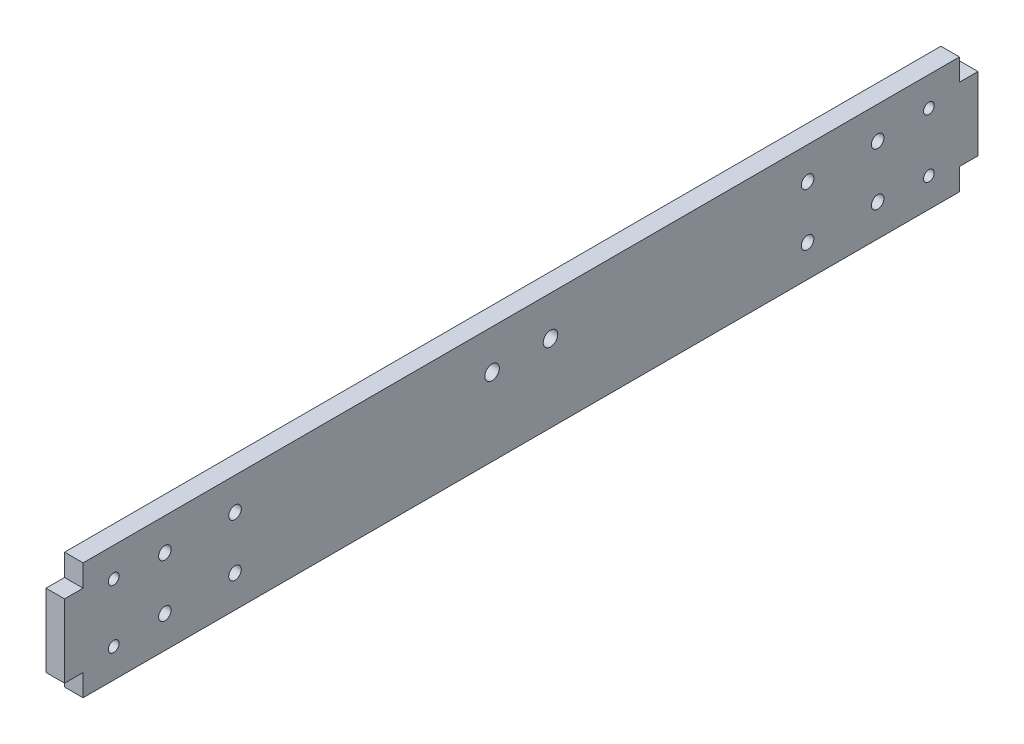
ISO-10303-21;
HEADER;
FILE_DESCRIPTION(('STEP AP214'),'2;1');
FILE_NAME('part.step','',(''),(''),'','','');
FILE_SCHEMA(('AUTOMOTIVE_DESIGN { 1 0 10303 214 1 1 1 1 }'));
ENDSEC;
DATA;
#1=APPLICATION_CONTEXT('core data for automotive mechanical design processes');
#2=APPLICATION_PROTOCOL_DEFINITION('international standard','automotive_design',2000,#1);
#3=PRODUCT_CONTEXT('',#1,'mechanical');
#4=PRODUCT('Part','Part','',(#3));
#5=PRODUCT_RELATED_PRODUCT_CATEGORY('part','',(#4));
#6=PRODUCT_DEFINITION_FORMATION('','',#4);
#7=PRODUCT_DEFINITION_CONTEXT('part definition',#1,'design');
#8=PRODUCT_DEFINITION('design','',#6,#7);
#9=PRODUCT_DEFINITION_SHAPE('','',#8);
#10=(LENGTH_UNIT() NAMED_UNIT(*) SI_UNIT(.MILLI.,.METRE.));
#11=(NAMED_UNIT(*) PLANE_ANGLE_UNIT() SI_UNIT($,.RADIAN.));
#12=(NAMED_UNIT(*) SI_UNIT($,.STERADIAN.) SOLID_ANGLE_UNIT());
#13=UNCERTAINTY_MEASURE_WITH_UNIT(LENGTH_MEASURE(1.E-05),#10,'distance_accuracy_value','');
#14=(GEOMETRIC_REPRESENTATION_CONTEXT(3) GLOBAL_UNCERTAINTY_ASSIGNED_CONTEXT((#13)) GLOBAL_UNIT_ASSIGNED_CONTEXT((#10,
#11,#12)) REPRESENTATION_CONTEXT('',''));
#15=CARTESIAN_POINT('',(0.,0.,0.));
#16=DIRECTION('',(0.,0.,1.));
#17=DIRECTION('',(1.,0.,0.));
#18=AXIS2_PLACEMENT_3D('',#15,#16,#17);
#19=CARTESIAN_POINT('',(6.35,-20.,-150.));
#20=DIRECTION('',(0.,0.,1.));
#21=DIRECTION('',(1.,0.,0.));
#22=AXIS2_PLACEMENT_3D('',#19,#20,#21);
#23=PLANE('',#22);
#24=DIRECTION('',(1.,0.,0.));
#25=VECTOR('',#24,1.);
#26=CARTESIAN_POINT('',(0.,12.5,-150.));
#27=LINE('',#26,#25);
#28=CARTESIAN_POINT('',(0.,12.5,-150.));
#29=VERTEX_POINT('',#28);
#30=CARTESIAN_POINT('',(6.35,12.5,-150.));
#31=VERTEX_POINT('',#30);
#32=EDGE_CURVE('E134',#29,#31,#27,.T.);
#33=ORIENTED_EDGE('',*,*,#32,.F.);
#34=DIRECTION('',(0.,1.,0.));
#35=VECTOR('',#34,1.);
#36=CARTESIAN_POINT('',(0.,-20.,-150.));
#37=LINE('',#36,#35);
#38=CARTESIAN_POINT('',(0.,20.,-150.));
#39=VERTEX_POINT('',#38);
#40=EDGE_CURVE('E146',#29,#39,#37,.T.);
#41=ORIENTED_EDGE('',*,*,#40,.T.);
#42=DIRECTION('',(-1.,0.,0.));
#43=VECTOR('',#42,1.);
#44=CARTESIAN_POINT('',(6.35,20.,-150.));
#45=LINE('',#44,#43);
#46=CARTESIAN_POINT('',(6.35,20.,-150.));
#47=VERTEX_POINT('',#46);
#48=EDGE_CURVE('E42',#47,#39,#45,.T.);
#49=ORIENTED_EDGE('',*,*,#48,.F.);
#50=DIRECTION('',(0.,1.,0.));
#51=VECTOR('',#50,1.);
#52=CARTESIAN_POINT('',(6.35,-20.,-150.));
#53=LINE('',#52,#51);
#54=EDGE_CURVE('E322',#31,#47,#53,.T.);
#55=ORIENTED_EDGE('',*,*,#54,.F.);
#56=EDGE_LOOP('',(#33,#41,#49,#55));
#57=FACE_BOUND('',#56,.T.);
#58=ADVANCED_FACE('F33',(#57),#23,.F.);
#59=CARTESIAN_POINT('',(6.35,-20.,150.));
#60=DIRECTION('',(0.,0.,-1.));
#61=DIRECTION('',(-1.,0.,0.));
#62=AXIS2_PLACEMENT_3D('',#59,#60,#61);
#63=PLANE('',#62);
#64=DIRECTION('',(1.,0.,0.));
#65=VECTOR('',#64,1.);
#66=CARTESIAN_POINT('',(0.,-12.5,150.));
#67=LINE('',#66,#65);
#68=CARTESIAN_POINT('',(0.,-12.5,150.));
#69=VERTEX_POINT('',#68);
#70=CARTESIAN_POINT('',(6.35,-12.5,150.));
#71=VERTEX_POINT('',#70);
#72=EDGE_CURVE('E335',#69,#71,#67,.T.);
#73=ORIENTED_EDGE('',*,*,#72,.F.);
#74=DIRECTION('',(0.,-1.,0.));
#75=VECTOR('',#74,1.);
#76=CARTESIAN_POINT('',(0.,-20.,150.));
#77=LINE('',#76,#75);
#78=CARTESIAN_POINT('',(0.,-20.,150.));
#79=VERTEX_POINT('',#78);
#80=EDGE_CURVE('E269',#69,#79,#77,.T.);
#81=ORIENTED_EDGE('',*,*,#80,.T.);
#82=DIRECTION('',(-1.,0.,0.));
#83=VECTOR('',#82,1.);
#84=CARTESIAN_POINT('',(6.35,-20.,150.));
#85=LINE('',#84,#83);
#86=CARTESIAN_POINT('',(6.35,-20.,150.));
#87=VERTEX_POINT('',#86);
#88=EDGE_CURVE('E285',#87,#79,#85,.T.);
#89=ORIENTED_EDGE('',*,*,#88,.F.);
#90=DIRECTION('',(0.,-1.,0.));
#91=VECTOR('',#90,1.);
#92=CARTESIAN_POINT('',(6.35,-20.,150.));
#93=LINE('',#92,#91);
#94=EDGE_CURVE('E307',#71,#87,#93,.T.);
#95=ORIENTED_EDGE('',*,*,#94,.F.);
#96=EDGE_LOOP('',(#73,#81,#89,#95));
#97=FACE_BOUND('',#96,.T.);
#98=ADVANCED_FACE('F243',(#97),#63,.F.);
#99=CARTESIAN_POINT('',(6.35,-20.,150.));
#100=DIRECTION('',(0.,1.,0.));
#101=DIRECTION('',(0.,0.,1.));
#102=AXIS2_PLACEMENT_3D('',#99,#100,#101);
#103=PLANE('',#102);
#104=DIRECTION('',(0.,0.,-1.));
#105=VECTOR('',#104,1.);
#106=CARTESIAN_POINT('',(0.,-20.,150.));
#107=LINE('',#106,#105);
#108=CARTESIAN_POINT('',(0.,-20.,-150.));
#109=VERTEX_POINT('',#108);
#110=EDGE_CURVE('E271',#79,#109,#107,.T.);
#111=ORIENTED_EDGE('',*,*,#110,.T.);
#112=DIRECTION('',(-1.,0.,0.));
#113=VECTOR('',#112,1.);
#114=CARTESIAN_POINT('',(6.35,-20.,-150.));
#115=LINE('',#114,#113);
#116=CARTESIAN_POINT('',(6.35,-20.,-150.));
#117=VERTEX_POINT('',#116);
#118=EDGE_CURVE('E11',#117,#109,#115,.T.);
#119=ORIENTED_EDGE('',*,*,#118,.F.);
#120=DIRECTION('',(0.,0.,-1.));
#121=VECTOR('',#120,1.);
#122=CARTESIAN_POINT('',(6.35,-20.,150.));
#123=LINE('',#122,#121);
#124=EDGE_CURVE('E293',#87,#117,#123,.T.);
#125=ORIENTED_EDGE('',*,*,#124,.F.);
#126=ORIENTED_EDGE('',*,*,#88,.T.);
#127=EDGE_LOOP('',(#111,#119,#125,#126));
#128=FACE_BOUND('',#127,.T.);
#129=ADVANCED_FACE('F35',(#128),#103,.F.);
#130=CARTESIAN_POINT('',(0.,-12.5,-150.));
#131=VERTEX_POINT('',#130);
#132=EDGE_CURVE('E263',#109,#131,#37,.T.);
#133=ORIENTED_EDGE('',*,*,#132,.T.);
#134=DIRECTION('',(1.,0.,0.));
#135=VECTOR('',#134,1.);
#136=CARTESIAN_POINT('',(0.,-12.5,-150.));
#137=LINE('',#136,#135);
#138=CARTESIAN_POINT('',(6.35,-12.5,-150.));
#139=VERTEX_POINT('',#138);
#140=EDGE_CURVE('E160',#131,#139,#137,.T.);
#141=ORIENTED_EDGE('',*,*,#140,.T.);
#142=EDGE_CURVE('E316',#117,#139,#53,.T.);
#143=ORIENTED_EDGE('',*,*,#142,.F.);
#144=ORIENTED_EDGE('',*,*,#118,.T.);
#145=EDGE_LOOP('',(#133,#141,#143,#144));
#146=FACE_BOUND('',#145,.T.);
#147=ADVANCED_FACE('F245',(#146),#23,.F.);
#148=CARTESIAN_POINT('',(6.35,20.,150.));
#149=DIRECTION('',(0.,-1.,0.));
#150=DIRECTION('',(0.,0.,-1.));
#151=AXIS2_PLACEMENT_3D('',#148,#149,#150);
#152=PLANE('',#151);
#153=DIRECTION('',(0.,0.,1.));
#154=VECTOR('',#153,1.);
#155=CARTESIAN_POINT('',(0.,20.,150.));
#156=LINE('',#155,#154);
#157=CARTESIAN_POINT('',(0.,20.,150.));
#158=VERTEX_POINT('',#157);
#159=EDGE_CURVE('E267',#39,#158,#156,.T.);
#160=ORIENTED_EDGE('',*,*,#159,.T.);
#161=DIRECTION('',(-1.,0.,0.));
#162=VECTOR('',#161,1.);
#163=CARTESIAN_POINT('',(6.35,20.,150.));
#164=LINE('',#163,#162);
#165=CARTESIAN_POINT('',(6.35,20.,150.));
#166=VERTEX_POINT('',#165);
#167=EDGE_CURVE('E296',#166,#158,#164,.T.);
#168=ORIENTED_EDGE('',*,*,#167,.F.);
#169=DIRECTION('',(0.,0.,1.));
#170=VECTOR('',#169,1.);
#171=CARTESIAN_POINT('',(6.35,20.,150.));
#172=LINE('',#171,#170);
#173=EDGE_CURVE('E309',#47,#166,#172,.T.);
#174=ORIENTED_EDGE('',*,*,#173,.F.);
#175=ORIENTED_EDGE('',*,*,#48,.T.);
#176=EDGE_LOOP('',(#160,#168,#174,#175));
#177=FACE_BOUND('',#176,.T.);
#178=ADVANCED_FACE('F254',(#177),#152,.F.);
#179=CARTESIAN_POINT('',(0.,12.5,150.));
#180=VERTEX_POINT('',#179);
#181=EDGE_CURVE('E291',#158,#180,#77,.T.);
#182=ORIENTED_EDGE('',*,*,#181,.T.);
#183=DIRECTION('',(1.,0.,0.));
#184=VECTOR('',#183,1.);
#185=CARTESIAN_POINT('',(0.,12.5,150.));
#186=LINE('',#185,#184);
#187=CARTESIAN_POINT('',(6.35,12.5,150.));
#188=VERTEX_POINT('',#187);
#189=EDGE_CURVE('E331',#180,#188,#186,.T.);
#190=ORIENTED_EDGE('',*,*,#189,.T.);
#191=EDGE_CURVE('E303',#166,#188,#93,.T.);
#192=ORIENTED_EDGE('',*,*,#191,.F.);
#193=ORIENTED_EDGE('',*,*,#167,.T.);
#194=EDGE_LOOP('',(#182,#190,#192,#193));
#195=FACE_BOUND('',#194,.T.);
#196=ADVANCED_FACE('F251',(#195),#63,.F.);
#197=CARTESIAN_POINT('',(6.35,0.,0.));
#198=DIRECTION('',(1.,0.,0.));
#199=DIRECTION('',(0.,0.,-1.));
#200=AXIS2_PLACEMENT_3D('',#197,#198,#199);
#201=PLANE('',#200);
#202=CARTESIAN_POINT('',(6.35,10.,139.5352));
#203=DIRECTION('',(1.,0.,0.));
#204=DIRECTION('',(0.,0.,-1.));
#205=AXIS2_PLACEMENT_3D('',#202,#203,#204);
#206=CIRCLE('',#205,1.82879999999999);
#207=CARTESIAN_POINT('',(6.35,10.,137.7064));
#208=VERTEX_POINT('',#207);
#209=EDGE_CURVE('E546',#208,#208,#206,.T.);
#210=ORIENTED_EDGE('',*,*,#209,.F.);
#211=EDGE_LOOP('',(#210));
#212=FACE_BOUND('',#211,.T.);
#213=CARTESIAN_POINT('',(6.35,-10.,139.5352));
#214=DIRECTION('',(1.,0.,0.));
#215=DIRECTION('',(0.,0.,-1.));
#216=AXIS2_PLACEMENT_3D('',#213,#214,#215);
#217=CIRCLE('',#216,1.82879999999999);
#218=CARTESIAN_POINT('',(6.35,-10.,137.7064));
#219=VERTEX_POINT('',#218);
#220=EDGE_CURVE('E550',#219,#219,#217,.T.);
#221=ORIENTED_EDGE('',*,*,#220,.F.);
#222=EDGE_LOOP('',(#221));
#223=FACE_BOUND('',#222,.T.);
#224=CARTESIAN_POINT('',(6.35,10.,-139.5352));
#225=DIRECTION('',(1.,0.,0.));
#226=DIRECTION('',(0.,0.,-1.));
#227=AXIS2_PLACEMENT_3D('',#224,#225,#226);
#228=CIRCLE('',#227,1.82879999999999);
#229=CARTESIAN_POINT('',(6.35,10.,-141.364));
#230=VERTEX_POINT('',#229);
#231=EDGE_CURVE('E559',#230,#230,#228,.T.);
#232=ORIENTED_EDGE('',*,*,#231,.F.);
#233=EDGE_LOOP('',(#232));
#234=FACE_BOUND('',#233,.T.);
#235=CARTESIAN_POINT('',(6.35,-10.,-139.5352));
#236=DIRECTION('',(1.,0.,0.));
#237=DIRECTION('',(0.,0.,-1.));
#238=AXIS2_PLACEMENT_3D('',#235,#236,#237);
#239=CIRCLE('',#238,1.82879999999999);
#240=CARTESIAN_POINT('',(6.35,-10.,-141.364));
#241=VERTEX_POINT('',#240);
#242=EDGE_CURVE('E565',#241,#241,#239,.T.);
#243=ORIENTED_EDGE('',*,*,#242,.F.);
#244=EDGE_LOOP('',(#243));
#245=FACE_BOUND('',#244,.T.);
#246=CARTESIAN_POINT('',(6.35,8.99999999999999,122.));
#247=DIRECTION('',(1.,0.,0.));
#248=DIRECTION('',(0.,0.,-1.));
#249=AXIS2_PLACEMENT_3D('',#246,#247,#248);
#250=CIRCLE('',#249,2.15264999999999);
#251=CARTESIAN_POINT('',(6.35,8.99999999999999,119.84735));
#252=VERTEX_POINT('',#251);
#253=EDGE_CURVE('E571',#252,#252,#250,.T.);
#254=ORIENTED_EDGE('',*,*,#253,.F.);
#255=EDGE_LOOP('',(#254));
#256=FACE_BOUND('',#255,.T.);
#257=CARTESIAN_POINT('',(6.35,8.99999999999999,98.));
#258=DIRECTION('',(1.,0.,0.));
#259=DIRECTION('',(0.,0.,-1.));
#260=AXIS2_PLACEMENT_3D('',#257,#258,#259);
#261=CIRCLE('',#260,2.15264999999999);
#262=CARTESIAN_POINT('',(6.35,8.99999999999999,95.84735));
#263=VERTEX_POINT('',#262);
#264=EDGE_CURVE('E577',#263,#263,#261,.T.);
#265=ORIENTED_EDGE('',*,*,#264,.F.);
#266=EDGE_LOOP('',(#265));
#267=FACE_BOUND('',#266,.T.);
#268=CARTESIAN_POINT('',(6.35,-9.00000000000001,98.));
#269=DIRECTION('',(1.,0.,0.));
#270=DIRECTION('',(0.,0.,-1.));
#271=AXIS2_PLACEMENT_3D('',#268,#269,#270);
#272=CIRCLE('',#271,2.15264999999999);
#273=CARTESIAN_POINT('',(6.35,-9.00000000000001,95.84735));
#274=VERTEX_POINT('',#273);
#275=EDGE_CURVE('E200',#274,#274,#272,.T.);
#276=ORIENTED_EDGE('',*,*,#275,.F.);
#277=EDGE_LOOP('',(#276));
#278=FACE_BOUND('',#277,.T.);
#279=CARTESIAN_POINT('',(6.35,-9.00000000000001,122.));
#280=DIRECTION('',(1.,0.,0.));
#281=DIRECTION('',(0.,0.,-1.));
#282=AXIS2_PLACEMENT_3D('',#279,#280,#281);
#283=CIRCLE('',#282,2.15264999999999);
#284=CARTESIAN_POINT('',(6.35,-9.00000000000001,119.84735));
#285=VERTEX_POINT('',#284);
#286=EDGE_CURVE('E188',#285,#285,#283,.T.);
#287=ORIENTED_EDGE('',*,*,#286,.F.);
#288=EDGE_LOOP('',(#287));
#289=FACE_BOUND('',#288,.T.);
#290=CARTESIAN_POINT('',(6.35,9.,-98.));
#291=DIRECTION('',(1.,0.,0.));
#292=DIRECTION('',(0.,0.,-1.));
#293=AXIS2_PLACEMENT_3D('',#290,#291,#292);
#294=CIRCLE('',#293,2.15264999999999);
#295=CARTESIAN_POINT('',(6.35,9.,-100.15265));
#296=VERTEX_POINT('',#295);
#297=EDGE_CURVE('E187',#296,#296,#294,.T.);
#298=ORIENTED_EDGE('',*,*,#297,.F.);
#299=EDGE_LOOP('',(#298));
#300=FACE_BOUND('',#299,.T.);
#301=CARTESIAN_POINT('',(6.35,9.00000000000001,-122.));
#302=DIRECTION('',(1.,0.,0.));
#303=DIRECTION('',(0.,0.,-1.));
#304=AXIS2_PLACEMENT_3D('',#301,#302,#303);
#305=CIRCLE('',#304,2.15264999999999);
#306=CARTESIAN_POINT('',(6.35,9.00000000000001,-124.15265));
#307=VERTEX_POINT('',#306);
#308=EDGE_CURVE('E206',#307,#307,#305,.T.);
#309=ORIENTED_EDGE('',*,*,#308,.F.);
#310=EDGE_LOOP('',(#309));
#311=FACE_BOUND('',#310,.T.);
#312=CARTESIAN_POINT('',(6.35,-8.99999999999999,-122.));
#313=DIRECTION('',(1.,0.,0.));
#314=DIRECTION('',(0.,0.,-1.));
#315=AXIS2_PLACEMENT_3D('',#312,#313,#314);
#316=CIRCLE('',#315,2.15264999999999);
#317=CARTESIAN_POINT('',(6.35,-8.99999999999999,-124.15265));
#318=VERTEX_POINT('',#317);
#319=EDGE_CURVE('E212',#318,#318,#316,.T.);
#320=ORIENTED_EDGE('',*,*,#319,.F.);
#321=EDGE_LOOP('',(#320));
#322=FACE_BOUND('',#321,.T.);
#323=CARTESIAN_POINT('',(6.35,-9.,-98.));
#324=DIRECTION('',(1.,0.,0.));
#325=DIRECTION('',(0.,0.,-1.));
#326=AXIS2_PLACEMENT_3D('',#323,#324,#325);
#327=CIRCLE('',#326,2.15264999999999);
#328=CARTESIAN_POINT('',(6.35,-9.,-100.15265));
#329=VERTEX_POINT('',#328);
#330=EDGE_CURVE('E184',#329,#329,#327,.T.);
#331=ORIENTED_EDGE('',*,*,#330,.F.);
#332=EDGE_LOOP('',(#331));
#333=FACE_BOUND('',#332,.T.);
#334=CARTESIAN_POINT('',(6.35,6.5,10.));
#335=DIRECTION('',(1.,0.,0.));
#336=DIRECTION('',(0.,0.,-1.));
#337=AXIS2_PLACEMENT_3D('',#334,#335,#336);
#338=CIRCLE('',#337,2.4892);
#339=CARTESIAN_POINT('',(6.35,6.5,7.5108));
#340=VERTEX_POINT('',#339);
#341=EDGE_CURVE('E181',#340,#340,#338,.T.);
#342=ORIENTED_EDGE('',*,*,#341,.F.);
#343=EDGE_LOOP('',(#342));
#344=FACE_BOUND('',#343,.T.);
#345=CARTESIAN_POINT('',(6.35,6.5,-10.));
#346=DIRECTION('',(1.,0.,0.));
#347=DIRECTION('',(0.,0.,-1.));
#348=AXIS2_PLACEMENT_3D('',#345,#346,#347);
#349=CIRCLE('',#348,2.4892);
#350=CARTESIAN_POINT('',(6.35,6.5,-12.4892));
#351=VERTEX_POINT('',#350);
#352=EDGE_CURVE('E180',#351,#351,#349,.T.);
#353=ORIENTED_EDGE('',*,*,#352,.F.);
#354=EDGE_LOOP('',(#353));
#355=FACE_BOUND('',#354,.T.);
#356=ORIENTED_EDGE('',*,*,#124,.T.);
#357=ORIENTED_EDGE('',*,*,#142,.T.);
#358=DIRECTION('',(0.,0.,-1.));
#359=VECTOR('',#358,1.);
#360=CARTESIAN_POINT('',(6.35,-12.5,-156.35));
#361=LINE('',#360,#359);
#362=CARTESIAN_POINT('',(6.35,-12.5,-156.35));
#363=VERTEX_POINT('',#362);
#364=EDGE_CURVE('E50',#139,#363,#361,.T.);
#365=ORIENTED_EDGE('',*,*,#364,.T.);
#366=DIRECTION('',(0.,1.,0.));
#367=VECTOR('',#366,1.);
#368=CARTESIAN_POINT('',(6.35,12.5,-156.35));
#369=LINE('',#368,#367);
#370=CARTESIAN_POINT('',(6.35,12.5,-156.35));
#371=VERTEX_POINT('',#370);
#372=EDGE_CURVE('E156',#363,#371,#369,.T.);
#373=ORIENTED_EDGE('',*,*,#372,.T.);
#374=DIRECTION('',(0.,0.,1.));
#375=VECTOR('',#374,1.);
#376=CARTESIAN_POINT('',(6.35,12.5,-156.35));
#377=LINE('',#376,#375);
#378=EDGE_CURVE('E129',#371,#31,#377,.T.);
#379=ORIENTED_EDGE('',*,*,#378,.T.);
#380=ORIENTED_EDGE('',*,*,#54,.T.);
#381=ORIENTED_EDGE('',*,*,#173,.T.);
#382=ORIENTED_EDGE('',*,*,#191,.T.);
#383=DIRECTION('',(0.,0.,1.));
#384=VECTOR('',#383,1.);
#385=CARTESIAN_POINT('',(6.35,12.5,156.35));
#386=LINE('',#385,#384);
#387=CARTESIAN_POINT('',(6.35,12.5,156.35));
#388=VERTEX_POINT('',#387);
#389=EDGE_CURVE('E58',#188,#388,#386,.T.);
#390=ORIENTED_EDGE('',*,*,#389,.T.);
#391=DIRECTION('',(0.,-1.,0.));
#392=VECTOR('',#391,1.);
#393=CARTESIAN_POINT('',(6.35,12.5,156.35));
#394=LINE('',#393,#392);
#395=CARTESIAN_POINT('',(6.35,-12.5,156.35));
#396=VERTEX_POINT('',#395);
#397=EDGE_CURVE('E159',#388,#396,#394,.T.);
#398=ORIENTED_EDGE('',*,*,#397,.T.);
#399=DIRECTION('',(0.,0.,-1.));
#400=VECTOR('',#399,1.);
#401=CARTESIAN_POINT('',(6.35,-12.5,156.35));
#402=LINE('',#401,#400);
#403=EDGE_CURVE('E356',#396,#71,#402,.T.);
#404=ORIENTED_EDGE('',*,*,#403,.T.);
#405=ORIENTED_EDGE('',*,*,#94,.T.);
#406=EDGE_LOOP('',(#356,#357,#365,#373,#379,#380,#381,#382,#390,#398,#404,#405));
#407=FACE_BOUND('',#406,.T.);
#408=ADVANCED_FACE('F326',(#212,#223,#234,#245,#256,#267,#278,#289,#300,#311,#322,#333,#344,
#355,#407),#201,.T.);
#409=CARTESIAN_POINT('',(0.,0.,0.));
#410=DIRECTION('',(1.,0.,0.));
#411=DIRECTION('',(0.,0.,-1.));
#412=AXIS2_PLACEMENT_3D('',#409,#410,#411);
#413=PLANE('',#412);
#414=CARTESIAN_POINT('',(0.,10.,139.5352));
#415=DIRECTION('',(1.,0.,0.));
#416=DIRECTION('',(0.,0.,-1.));
#417=AXIS2_PLACEMENT_3D('',#414,#415,#416);
#418=CIRCLE('',#417,1.82879999999999);
#419=CARTESIAN_POINT('',(0.,10.,137.7064));
#420=VERTEX_POINT('',#419);
#421=EDGE_CURVE('E549',#420,#420,#418,.T.);
#422=ORIENTED_EDGE('',*,*,#421,.T.);
#423=EDGE_LOOP('',(#422));
#424=FACE_BOUND('',#423,.T.);
#425=CARTESIAN_POINT('',(0.,-10.,139.5352));
#426=DIRECTION('',(1.,0.,0.));
#427=DIRECTION('',(0.,0.,-1.));
#428=AXIS2_PLACEMENT_3D('',#425,#426,#427);
#429=CIRCLE('',#428,1.82879999999999);
#430=CARTESIAN_POINT('',(0.,-10.,137.7064));
#431=VERTEX_POINT('',#430);
#432=EDGE_CURVE('E553',#431,#431,#429,.T.);
#433=ORIENTED_EDGE('',*,*,#432,.T.);
#434=EDGE_LOOP('',(#433));
#435=FACE_BOUND('',#434,.T.);
#436=CARTESIAN_POINT('',(0.,10.,-139.5352));
#437=DIRECTION('',(1.,0.,0.));
#438=DIRECTION('',(0.,0.,-1.));
#439=AXIS2_PLACEMENT_3D('',#436,#437,#438);
#440=CIRCLE('',#439,1.82879999999999);
#441=CARTESIAN_POINT('',(0.,10.,-141.364));
#442=VERTEX_POINT('',#441);
#443=EDGE_CURVE('E562',#442,#442,#440,.T.);
#444=ORIENTED_EDGE('',*,*,#443,.T.);
#445=EDGE_LOOP('',(#444));
#446=FACE_BOUND('',#445,.T.);
#447=CARTESIAN_POINT('',(0.,-10.,-139.5352));
#448=DIRECTION('',(1.,0.,0.));
#449=DIRECTION('',(0.,0.,-1.));
#450=AXIS2_PLACEMENT_3D('',#447,#448,#449);
#451=CIRCLE('',#450,1.82879999999999);
#452=CARTESIAN_POINT('',(0.,-10.,-141.364));
#453=VERTEX_POINT('',#452);
#454=EDGE_CURVE('E568',#453,#453,#451,.T.);
#455=ORIENTED_EDGE('',*,*,#454,.T.);
#456=EDGE_LOOP('',(#455));
#457=FACE_BOUND('',#456,.T.);
#458=CARTESIAN_POINT('',(0.,8.99999999999999,122.));
#459=DIRECTION('',(1.,0.,0.));
#460=DIRECTION('',(0.,0.,-1.));
#461=AXIS2_PLACEMENT_3D('',#458,#459,#460);
#462=CIRCLE('',#461,2.15264999999999);
#463=CARTESIAN_POINT('',(0.,8.99999999999999,119.84735));
#464=VERTEX_POINT('',#463);
#465=EDGE_CURVE('E574',#464,#464,#462,.T.);
#466=ORIENTED_EDGE('',*,*,#465,.T.);
#467=EDGE_LOOP('',(#466));
#468=FACE_BOUND('',#467,.T.);
#469=CARTESIAN_POINT('',(0.,8.99999999999999,98.));
#470=DIRECTION('',(1.,0.,0.));
#471=DIRECTION('',(0.,0.,-1.));
#472=AXIS2_PLACEMENT_3D('',#469,#470,#471);
#473=CIRCLE('',#472,2.15264999999999);
#474=CARTESIAN_POINT('',(0.,8.99999999999999,95.84735));
#475=VERTEX_POINT('',#474);
#476=EDGE_CURVE('E37',#475,#475,#473,.T.);
#477=ORIENTED_EDGE('',*,*,#476,.T.);
#478=EDGE_LOOP('',(#477));
#479=FACE_BOUND('',#478,.T.);
#480=CARTESIAN_POINT('',(0.,-9.00000000000001,98.));
#481=DIRECTION('',(1.,0.,0.));
#482=DIRECTION('',(0.,0.,-1.));
#483=AXIS2_PLACEMENT_3D('',#480,#481,#482);
#484=CIRCLE('',#483,2.15264999999999);
#485=CARTESIAN_POINT('',(0.,-9.00000000000001,95.84735));
#486=VERTEX_POINT('',#485);
#487=EDGE_CURVE('E195',#486,#486,#484,.T.);
#488=ORIENTED_EDGE('',*,*,#487,.T.);
#489=EDGE_LOOP('',(#488));
#490=FACE_BOUND('',#489,.T.);
#491=CARTESIAN_POINT('',(0.,-9.00000000000001,122.));
#492=DIRECTION('',(1.,0.,0.));
#493=DIRECTION('',(0.,0.,-1.));
#494=AXIS2_PLACEMENT_3D('',#491,#492,#493);
#495=CIRCLE('',#494,2.15264999999999);
#496=CARTESIAN_POINT('',(0.,-9.00000000000001,119.84735));
#497=VERTEX_POINT('',#496);
#498=EDGE_CURVE('E185',#497,#497,#495,.T.);
#499=ORIENTED_EDGE('',*,*,#498,.T.);
#500=EDGE_LOOP('',(#499));
#501=FACE_BOUND('',#500,.T.);
#502=CARTESIAN_POINT('',(0.,9.,-98.));
#503=DIRECTION('',(1.,0.,0.));
#504=DIRECTION('',(0.,0.,-1.));
#505=AXIS2_PLACEMENT_3D('',#502,#503,#504);
#506=CIRCLE('',#505,2.15264999999999);
#507=CARTESIAN_POINT('',(0.,9.,-100.15265));
#508=VERTEX_POINT('',#507);
#509=EDGE_CURVE('E192',#508,#508,#506,.T.);
#510=ORIENTED_EDGE('',*,*,#509,.T.);
#511=EDGE_LOOP('',(#510));
#512=FACE_BOUND('',#511,.T.);
#513=CARTESIAN_POINT('',(0.,9.00000000000001,-122.));
#514=DIRECTION('',(1.,0.,0.));
#515=DIRECTION('',(0.,0.,-1.));
#516=AXIS2_PLACEMENT_3D('',#513,#514,#515);
#517=CIRCLE('',#516,2.15264999999999);
#518=CARTESIAN_POINT('',(0.,9.00000000000001,-124.15265));
#519=VERTEX_POINT('',#518);
#520=EDGE_CURVE('E209',#519,#519,#517,.T.);
#521=ORIENTED_EDGE('',*,*,#520,.T.);
#522=EDGE_LOOP('',(#521));
#523=FACE_BOUND('',#522,.T.);
#524=CARTESIAN_POINT('',(0.,-8.99999999999999,-122.));
#525=DIRECTION('',(1.,0.,0.));
#526=DIRECTION('',(0.,0.,-1.));
#527=AXIS2_PLACEMENT_3D('',#524,#525,#526);
#528=CIRCLE('',#527,2.15264999999999);
#529=CARTESIAN_POINT('',(0.,-8.99999999999999,-124.15265));
#530=VERTEX_POINT('',#529);
#531=EDGE_CURVE('E215',#530,#530,#528,.T.);
#532=ORIENTED_EDGE('',*,*,#531,.T.);
#533=EDGE_LOOP('',(#532));
#534=FACE_BOUND('',#533,.T.);
#535=CARTESIAN_POINT('',(0.,-9.,-98.));
#536=DIRECTION('',(1.,0.,0.));
#537=DIRECTION('',(0.,0.,-1.));
#538=AXIS2_PLACEMENT_3D('',#535,#536,#537);
#539=CIRCLE('',#538,2.15264999999999);
#540=CARTESIAN_POINT('',(0.,-9.,-100.15265));
#541=VERTEX_POINT('',#540);
#542=EDGE_CURVE('E182',#541,#541,#539,.T.);
#543=ORIENTED_EDGE('',*,*,#542,.T.);
#544=EDGE_LOOP('',(#543));
#545=FACE_BOUND('',#544,.T.);
#546=CARTESIAN_POINT('',(0.,6.5,10.));
#547=DIRECTION('',(1.,0.,0.));
#548=DIRECTION('',(0.,0.,-1.));
#549=AXIS2_PLACEMENT_3D('',#546,#547,#548);
#550=CIRCLE('',#549,2.4892);
#551=CARTESIAN_POINT('',(0.,6.5,7.5108));
#552=VERTEX_POINT('',#551);
#553=EDGE_CURVE('E177',#552,#552,#550,.T.);
#554=ORIENTED_EDGE('',*,*,#553,.T.);
#555=EDGE_LOOP('',(#554));
#556=FACE_BOUND('',#555,.T.);
#557=CARTESIAN_POINT('',(0.,6.5,-10.));
#558=DIRECTION('',(1.,0.,0.));
#559=DIRECTION('',(0.,0.,-1.));
#560=AXIS2_PLACEMENT_3D('',#557,#558,#559);
#561=CIRCLE('',#560,2.4892);
#562=CARTESIAN_POINT('',(0.,6.5,-12.4892));
#563=VERTEX_POINT('',#562);
#564=EDGE_CURVE('E154',#563,#563,#561,.T.);
#565=ORIENTED_EDGE('',*,*,#564,.T.);
#566=EDGE_LOOP('',(#565));
#567=FACE_BOUND('',#566,.T.);
#568=ORIENTED_EDGE('',*,*,#110,.F.);
#569=ORIENTED_EDGE('',*,*,#80,.F.);
#570=DIRECTION('',(0.,0.,-1.));
#571=VECTOR('',#570,1.);
#572=CARTESIAN_POINT('',(0.,-12.5,156.35));
#573=LINE('',#572,#571);
#574=CARTESIAN_POINT('',(0.,-12.5,156.35));
#575=VERTEX_POINT('',#574);
#576=EDGE_CURVE('E349',#575,#69,#573,.T.);
#577=ORIENTED_EDGE('',*,*,#576,.F.);
#578=DIRECTION('',(0.,-1.,0.));
#579=VECTOR('',#578,1.);
#580=CARTESIAN_POINT('',(0.,12.5,156.35));
#581=LINE('',#580,#579);
#582=CARTESIAN_POINT('',(0.,12.5,156.35));
#583=VERTEX_POINT('',#582);
#584=EDGE_CURVE('E354',#583,#575,#581,.T.);
#585=ORIENTED_EDGE('',*,*,#584,.F.);
#586=DIRECTION('',(0.,0.,1.));
#587=VECTOR('',#586,1.);
#588=CARTESIAN_POINT('',(0.,12.5,156.35));
#589=LINE('',#588,#587);
#590=EDGE_CURVE('E346',#180,#583,#589,.T.);
#591=ORIENTED_EDGE('',*,*,#590,.F.);
#592=ORIENTED_EDGE('',*,*,#181,.F.);
#593=ORIENTED_EDGE('',*,*,#159,.F.);
#594=ORIENTED_EDGE('',*,*,#40,.F.);
#595=DIRECTION('',(0.,0.,1.));
#596=VECTOR('',#595,1.);
#597=CARTESIAN_POINT('',(0.,12.5,-156.35));
#598=LINE('',#597,#596);
#599=CARTESIAN_POINT('',(0.,12.5,-156.35));
#600=VERTEX_POINT('',#599);
#601=EDGE_CURVE('E126',#600,#29,#598,.T.);
#602=ORIENTED_EDGE('',*,*,#601,.F.);
#603=DIRECTION('',(0.,1.,0.));
#604=VECTOR('',#603,1.);
#605=CARTESIAN_POINT('',(0.,12.5,-156.35));
#606=LINE('',#605,#604);
#607=CARTESIAN_POINT('',(0.,-12.5,-156.35));
#608=VERTEX_POINT('',#607);
#609=EDGE_CURVE('E143',#608,#600,#606,.T.);
#610=ORIENTED_EDGE('',*,*,#609,.F.);
#611=DIRECTION('',(0.,0.,-1.));
#612=VECTOR('',#611,1.);
#613=CARTESIAN_POINT('',(0.,-12.5,-156.35));
#614=LINE('',#613,#612);
#615=EDGE_CURVE('E135',#131,#608,#614,.T.);
#616=ORIENTED_EDGE('',*,*,#615,.F.);
#617=ORIENTED_EDGE('',*,*,#132,.F.);
#618=EDGE_LOOP('',(#568,#569,#577,#585,#591,#592,#593,#594,#602,#610,#616,#617));
#619=FACE_BOUND('',#618,.T.);
#620=ADVANCED_FACE('F141',(#424,#435,#446,#457,#468,#479,#490,#501,#512,#523,#534,#545,#556,
#567,#619),#413,.F.);
#621=CARTESIAN_POINT('',(0.,12.5,156.35));
#622=DIRECTION('',(0.,0.,1.));
#623=DIRECTION('',(1.,0.,0.));
#624=AXIS2_PLACEMENT_3D('',#621,#622,#623);
#625=PLANE('',#624);
#626=ORIENTED_EDGE('',*,*,#397,.F.);
#627=DIRECTION('',(1.,0.,0.));
#628=VECTOR('',#627,1.);
#629=CARTESIAN_POINT('',(0.,12.5,156.35));
#630=LINE('',#629,#628);
#631=EDGE_CURVE('E330',#583,#388,#630,.T.);
#632=ORIENTED_EDGE('',*,*,#631,.F.);
#633=ORIENTED_EDGE('',*,*,#584,.T.);
#634=DIRECTION('',(1.,0.,0.));
#635=VECTOR('',#634,1.);
#636=CARTESIAN_POINT('',(0.,-12.5,156.35));
#637=LINE('',#636,#635);
#638=EDGE_CURVE('E348',#575,#396,#637,.T.);
#639=ORIENTED_EDGE('',*,*,#638,.T.);
#640=EDGE_LOOP('',(#626,#632,#633,#639));
#641=FACE_BOUND('',#640,.T.);
#642=ADVANCED_FACE('F360',(#641),#625,.T.);
#643=CARTESIAN_POINT('',(0.,12.5,156.35));
#644=DIRECTION('',(0.,1.,0.));
#645=DIRECTION('',(0.,0.,1.));
#646=AXIS2_PLACEMENT_3D('',#643,#644,#645);
#647=PLANE('',#646);
#648=ORIENTED_EDGE('',*,*,#389,.F.);
#649=ORIENTED_EDGE('',*,*,#189,.F.);
#650=ORIENTED_EDGE('',*,*,#590,.T.);
#651=ORIENTED_EDGE('',*,*,#631,.T.);
#652=EDGE_LOOP('',(#648,#649,#650,#651));
#653=FACE_BOUND('',#652,.T.);
#654=ADVANCED_FACE('F368',(#653),#647,.T.);
#655=CARTESIAN_POINT('',(0.,-12.5,156.35));
#656=DIRECTION('',(0.,-1.,0.));
#657=DIRECTION('',(0.,0.,-1.));
#658=AXIS2_PLACEMENT_3D('',#655,#656,#657);
#659=PLANE('',#658);
#660=ORIENTED_EDGE('',*,*,#403,.F.);
#661=ORIENTED_EDGE('',*,*,#638,.F.);
#662=ORIENTED_EDGE('',*,*,#576,.T.);
#663=ORIENTED_EDGE('',*,*,#72,.T.);
#664=EDGE_LOOP('',(#660,#661,#662,#663));
#665=FACE_BOUND('',#664,.T.);
#666=ADVANCED_FACE('F365',(#665),#659,.T.);
#667=CARTESIAN_POINT('',(0.,12.5,-156.35));
#668=DIRECTION('',(0.,0.,-1.));
#669=DIRECTION('',(-1.,0.,0.));
#670=AXIS2_PLACEMENT_3D('',#667,#668,#669);
#671=PLANE('',#670);
#672=ORIENTED_EDGE('',*,*,#372,.F.);
#673=DIRECTION('',(1.,0.,0.));
#674=VECTOR('',#673,1.);
#675=CARTESIAN_POINT('',(0.,-12.5,-156.35));
#676=LINE('',#675,#674);
#677=EDGE_CURVE('E149',#608,#363,#676,.T.);
#678=ORIENTED_EDGE('',*,*,#677,.F.);
#679=ORIENTED_EDGE('',*,*,#609,.T.);
#680=DIRECTION('',(1.,0.,0.));
#681=VECTOR('',#680,1.);
#682=CARTESIAN_POINT('',(0.,12.5,-156.35));
#683=LINE('',#682,#681);
#684=EDGE_CURVE('E123',#600,#371,#683,.T.);
#685=ORIENTED_EDGE('',*,*,#684,.T.);
#686=EDGE_LOOP('',(#672,#678,#679,#685));
#687=FACE_BOUND('',#686,.T.);
#688=ADVANCED_FACE('F148',(#687),#671,.T.);
#689=CARTESIAN_POINT('',(0.,-12.5,-156.35));
#690=DIRECTION('',(0.,-1.,0.));
#691=DIRECTION('',(0.,0.,-1.));
#692=AXIS2_PLACEMENT_3D('',#689,#690,#691);
#693=PLANE('',#692);
#694=ORIENTED_EDGE('',*,*,#364,.F.);
#695=ORIENTED_EDGE('',*,*,#140,.F.);
#696=ORIENTED_EDGE('',*,*,#615,.T.);
#697=ORIENTED_EDGE('',*,*,#677,.T.);
#698=EDGE_LOOP('',(#694,#695,#696,#697));
#699=FACE_BOUND('',#698,.T.);
#700=ADVANCED_FACE('F239',(#699),#693,.T.);
#701=CARTESIAN_POINT('',(0.,12.5,-156.35));
#702=DIRECTION('',(0.,1.,0.));
#703=DIRECTION('',(0.,0.,1.));
#704=AXIS2_PLACEMENT_3D('',#701,#702,#703);
#705=PLANE('',#704);
#706=ORIENTED_EDGE('',*,*,#378,.F.);
#707=ORIENTED_EDGE('',*,*,#684,.F.);
#708=ORIENTED_EDGE('',*,*,#601,.T.);
#709=ORIENTED_EDGE('',*,*,#32,.T.);
#710=EDGE_LOOP('',(#706,#707,#708,#709));
#711=FACE_BOUND('',#710,.T.);
#712=ADVANCED_FACE('F125',(#711),#705,.T.);
#713=CARTESIAN_POINT('',(6.35,6.5,-10.));
#714=DIRECTION('',(1.,0.,0.));
#715=DIRECTION('',(0.,0.,-1.));
#716=AXIS2_PLACEMENT_3D('',#713,#714,#715);
#717=CYLINDRICAL_SURFACE('',#716,2.4892);
#718=ORIENTED_EDGE('',*,*,#352,.T.);
#719=EDGE_LOOP('',(#718));
#720=FACE_BOUND('',#719,.T.);
#721=ORIENTED_EDGE('',*,*,#564,.F.);
#722=EDGE_LOOP('',(#721));
#723=FACE_BOUND('',#722,.T.);
#724=ADVANCED_FACE('F228',(#720,#723),#717,.F.);
#725=CARTESIAN_POINT('',(6.35,6.5,10.));
#726=DIRECTION('',(1.,0.,0.));
#727=DIRECTION('',(0.,0.,-1.));
#728=AXIS2_PLACEMENT_3D('',#725,#726,#727);
#729=CYLINDRICAL_SURFACE('',#728,2.4892);
#730=ORIENTED_EDGE('',*,*,#341,.T.);
#731=EDGE_LOOP('',(#730));
#732=FACE_BOUND('',#731,.T.);
#733=ORIENTED_EDGE('',*,*,#553,.F.);
#734=EDGE_LOOP('',(#733));
#735=FACE_BOUND('',#734,.T.);
#736=ADVANCED_FACE('F230',(#732,#735),#729,.F.);
#737=CARTESIAN_POINT('',(6.35,-9.,-98.));
#738=DIRECTION('',(1.,0.,0.));
#739=DIRECTION('',(0.,0.,-1.));
#740=AXIS2_PLACEMENT_3D('',#737,#738,#739);
#741=CYLINDRICAL_SURFACE('',#740,2.15264999999999);
#742=ORIENTED_EDGE('',*,*,#330,.T.);
#743=EDGE_LOOP('',(#742));
#744=FACE_BOUND('',#743,.T.);
#745=ORIENTED_EDGE('',*,*,#542,.F.);
#746=EDGE_LOOP('',(#745));
#747=FACE_BOUND('',#746,.T.);
#748=ADVANCED_FACE('F236',(#744,#747),#741,.F.);
#749=CARTESIAN_POINT('',(6.35,-8.99999999999999,-122.));
#750=DIRECTION('',(1.,0.,0.));
#751=DIRECTION('',(0.,0.,-1.));
#752=AXIS2_PLACEMENT_3D('',#749,#750,#751);
#753=CYLINDRICAL_SURFACE('',#752,2.15264999999999);
#754=ORIENTED_EDGE('',*,*,#319,.T.);
#755=EDGE_LOOP('',(#754));
#756=FACE_BOUND('',#755,.T.);
#757=ORIENTED_EDGE('',*,*,#531,.F.);
#758=EDGE_LOOP('',(#757));
#759=FACE_BOUND('',#758,.T.);
#760=ADVANCED_FACE('F415',(#756,#759),#753,.F.);
#761=CARTESIAN_POINT('',(6.35,9.00000000000001,-122.));
#762=DIRECTION('',(1.,0.,0.));
#763=DIRECTION('',(0.,0.,-1.));
#764=AXIS2_PLACEMENT_3D('',#761,#762,#763);
#765=CYLINDRICAL_SURFACE('',#764,2.15264999999999);
#766=ORIENTED_EDGE('',*,*,#308,.T.);
#767=EDGE_LOOP('',(#766));
#768=FACE_BOUND('',#767,.T.);
#769=ORIENTED_EDGE('',*,*,#520,.F.);
#770=EDGE_LOOP('',(#769));
#771=FACE_BOUND('',#770,.T.);
#772=ADVANCED_FACE('F425',(#768,#771),#765,.F.);
#773=CARTESIAN_POINT('',(6.35,9.,-98.));
#774=DIRECTION('',(1.,0.,0.));
#775=DIRECTION('',(0.,0.,-1.));
#776=AXIS2_PLACEMENT_3D('',#773,#774,#775);
#777=CYLINDRICAL_SURFACE('',#776,2.15264999999999);
#778=ORIENTED_EDGE('',*,*,#297,.T.);
#779=EDGE_LOOP('',(#778));
#780=FACE_BOUND('',#779,.T.);
#781=ORIENTED_EDGE('',*,*,#509,.F.);
#782=EDGE_LOOP('',(#781));
#783=FACE_BOUND('',#782,.T.);
#784=ADVANCED_FACE('F435',(#780,#783),#777,.F.);
#785=CARTESIAN_POINT('',(6.35,-9.00000000000001,122.));
#786=DIRECTION('',(1.,0.,0.));
#787=DIRECTION('',(0.,0.,-1.));
#788=AXIS2_PLACEMENT_3D('',#785,#786,#787);
#789=CYLINDRICAL_SURFACE('',#788,2.15264999999999);
#790=ORIENTED_EDGE('',*,*,#286,.T.);
#791=EDGE_LOOP('',(#790));
#792=FACE_BOUND('',#791,.T.);
#793=ORIENTED_EDGE('',*,*,#498,.F.);
#794=EDGE_LOOP('',(#793));
#795=FACE_BOUND('',#794,.T.);
#796=ADVANCED_FACE('F445',(#792,#795),#789,.F.);
#797=CARTESIAN_POINT('',(6.35,-9.00000000000001,98.));
#798=DIRECTION('',(1.,0.,0.));
#799=DIRECTION('',(0.,0.,-1.));
#800=AXIS2_PLACEMENT_3D('',#797,#798,#799);
#801=CYLINDRICAL_SURFACE('',#800,2.15264999999999);
#802=ORIENTED_EDGE('',*,*,#275,.T.);
#803=EDGE_LOOP('',(#802));
#804=FACE_BOUND('',#803,.T.);
#805=ORIENTED_EDGE('',*,*,#487,.F.);
#806=EDGE_LOOP('',(#805));
#807=FACE_BOUND('',#806,.T.);
#808=ADVANCED_FACE('F455',(#804,#807),#801,.F.);
#809=CARTESIAN_POINT('',(6.35,8.99999999999999,98.));
#810=DIRECTION('',(1.,0.,0.));
#811=DIRECTION('',(0.,0.,-1.));
#812=AXIS2_PLACEMENT_3D('',#809,#810,#811);
#813=CYLINDRICAL_SURFACE('',#812,2.15264999999999);
#814=ORIENTED_EDGE('',*,*,#264,.T.);
#815=EDGE_LOOP('',(#814));
#816=FACE_BOUND('',#815,.T.);
#817=ORIENTED_EDGE('',*,*,#476,.F.);
#818=EDGE_LOOP('',(#817));
#819=FACE_BOUND('',#818,.T.);
#820=ADVANCED_FACE('F464',(#816,#819),#813,.F.);
#821=CARTESIAN_POINT('',(6.35,8.99999999999999,122.));
#822=DIRECTION('',(1.,0.,0.));
#823=DIRECTION('',(0.,0.,-1.));
#824=AXIS2_PLACEMENT_3D('',#821,#822,#823);
#825=CYLINDRICAL_SURFACE('',#824,2.15264999999999);
#826=ORIENTED_EDGE('',*,*,#253,.T.);
#827=EDGE_LOOP('',(#826));
#828=FACE_BOUND('',#827,.T.);
#829=ORIENTED_EDGE('',*,*,#465,.F.);
#830=EDGE_LOOP('',(#829));
#831=FACE_BOUND('',#830,.T.);
#832=ADVANCED_FACE('F474',(#828,#831),#825,.F.);
#833=CARTESIAN_POINT('',(6.35,-10.,-139.5352));
#834=DIRECTION('',(1.,0.,0.));
#835=DIRECTION('',(0.,0.,-1.));
#836=AXIS2_PLACEMENT_3D('',#833,#834,#835);
#837=CYLINDRICAL_SURFACE('',#836,1.82879999999999);
#838=ORIENTED_EDGE('',*,*,#242,.T.);
#839=EDGE_LOOP('',(#838));
#840=FACE_BOUND('',#839,.T.);
#841=ORIENTED_EDGE('',*,*,#454,.F.);
#842=EDGE_LOOP('',(#841));
#843=FACE_BOUND('',#842,.T.);
#844=ADVANCED_FACE('F484',(#840,#843),#837,.F.);
#845=CARTESIAN_POINT('',(6.35,10.,-139.5352));
#846=DIRECTION('',(1.,0.,0.));
#847=DIRECTION('',(0.,0.,-1.));
#848=AXIS2_PLACEMENT_3D('',#845,#846,#847);
#849=CYLINDRICAL_SURFACE('',#848,1.82879999999999);
#850=ORIENTED_EDGE('',*,*,#231,.T.);
#851=EDGE_LOOP('',(#850));
#852=FACE_BOUND('',#851,.T.);
#853=ORIENTED_EDGE('',*,*,#443,.F.);
#854=EDGE_LOOP('',(#853));
#855=FACE_BOUND('',#854,.T.);
#856=ADVANCED_FACE('F509',(#852,#855),#849,.F.);
#857=CARTESIAN_POINT('',(6.35,-10.,139.5352));
#858=DIRECTION('',(1.,0.,0.));
#859=DIRECTION('',(0.,0.,-1.));
#860=AXIS2_PLACEMENT_3D('',#857,#858,#859);
#861=CYLINDRICAL_SURFACE('',#860,1.82879999999999);
#862=ORIENTED_EDGE('',*,*,#220,.T.);
#863=EDGE_LOOP('',(#862));
#864=FACE_BOUND('',#863,.T.);
#865=ORIENTED_EDGE('',*,*,#432,.F.);
#866=EDGE_LOOP('',(#865));
#867=FACE_BOUND('',#866,.T.);
#868=ADVANCED_FACE('F519',(#864,#867),#861,.F.);
#869=CARTESIAN_POINT('',(6.35,10.,139.5352));
#870=DIRECTION('',(1.,0.,0.));
#871=DIRECTION('',(0.,0.,-1.));
#872=AXIS2_PLACEMENT_3D('',#869,#870,#871);
#873=CYLINDRICAL_SURFACE('',#872,1.82879999999999);
#874=ORIENTED_EDGE('',*,*,#209,.T.);
#875=EDGE_LOOP('',(#874));
#876=FACE_BOUND('',#875,.T.);
#877=ORIENTED_EDGE('',*,*,#421,.F.);
#878=EDGE_LOOP('',(#877));
#879=FACE_BOUND('',#878,.T.);
#880=ADVANCED_FACE('F529',(#876,#879),#873,.F.);
#881=CLOSED_SHELL('',(#58,#98,#129,#147,#178,#196,#408,#620,#642,#654,#666,#688,#700,#712,#724,
#736,#748,#760,#772,#784,#796,#808,#820,#832,#844,#856,#868,#880));
#882=MANIFOLD_SOLID_BREP('B2',#881);
#883=ADVANCED_BREP_SHAPE_REPRESENTATION('',(#18,#882),#14);
#884=SHAPE_DEFINITION_REPRESENTATION(#9,#883);
ENDSEC;
END-ISO-10303-21;
